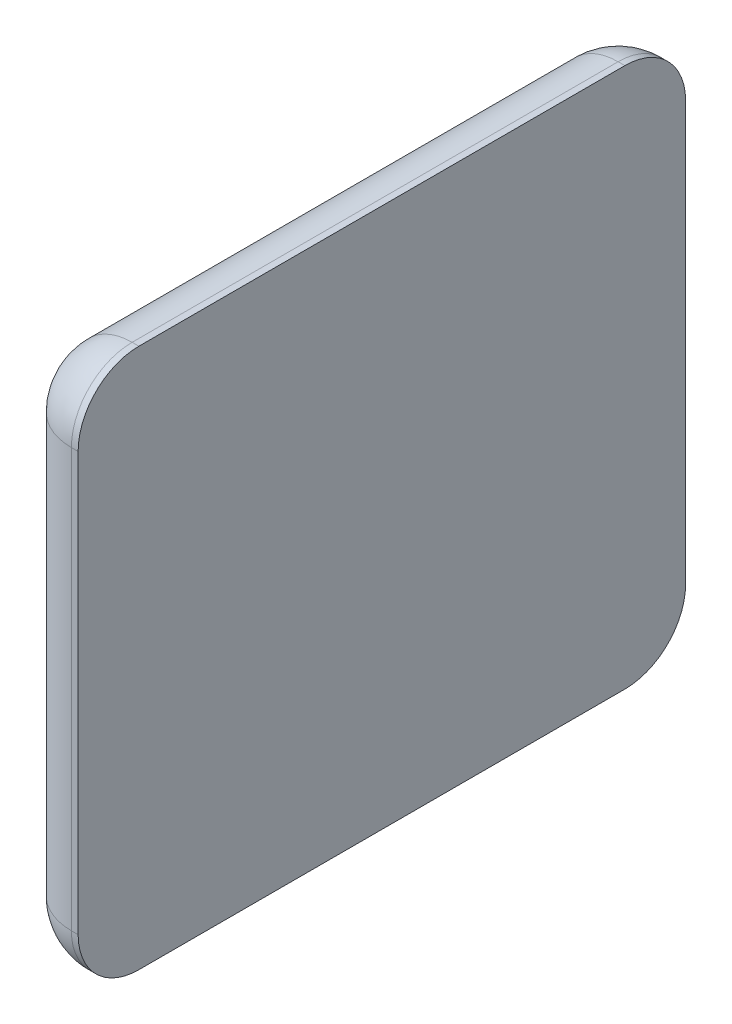
ISO-10303-21;
HEADER;
FILE_DESCRIPTION(('STEP AP214'),'2;1');
FILE_NAME('part.step','',(''),(''),'','','');
FILE_SCHEMA(('AUTOMOTIVE_DESIGN { 1 0 10303 214 1 1 1 1 }'));
ENDSEC;
DATA;
#1=APPLICATION_CONTEXT('core data for automotive mechanical design processes');
#2=APPLICATION_PROTOCOL_DEFINITION('international standard','automotive_design',2000,#1);
#3=PRODUCT_CONTEXT('',#1,'mechanical');
#4=PRODUCT('Part','Part','',(#3));
#5=PRODUCT_RELATED_PRODUCT_CATEGORY('part','',(#4));
#6=PRODUCT_DEFINITION_FORMATION('','',#4);
#7=PRODUCT_DEFINITION_CONTEXT('part definition',#1,'design');
#8=PRODUCT_DEFINITION('design','',#6,#7);
#9=PRODUCT_DEFINITION_SHAPE('','',#8);
#10=(LENGTH_UNIT() NAMED_UNIT(*) SI_UNIT(.MILLI.,.METRE.));
#11=(NAMED_UNIT(*) PLANE_ANGLE_UNIT() SI_UNIT($,.RADIAN.));
#12=(NAMED_UNIT(*) SI_UNIT($,.STERADIAN.) SOLID_ANGLE_UNIT());
#13=UNCERTAINTY_MEASURE_WITH_UNIT(LENGTH_MEASURE(1.E-05),#10,'distance_accuracy_value','');
#14=(GEOMETRIC_REPRESENTATION_CONTEXT(3) GLOBAL_UNCERTAINTY_ASSIGNED_CONTEXT((#13)) GLOBAL_UNIT_ASSIGNED_CONTEXT((#10,
#11,#12)) REPRESENTATION_CONTEXT('',''));
#15=CARTESIAN_POINT('',(0.,0.,0.));
#16=DIRECTION('',(0.,0.,1.));
#17=DIRECTION('',(1.,0.,0.));
#18=AXIS2_PLACEMENT_3D('',#15,#16,#17);
#19=CARTESIAN_POINT('',(-1.6,-0.8,0.));
#20=DIRECTION('',(1.,0.,0.));
#21=DIRECTION('',(0.,0.,1.));
#22=AXIS2_PLACEMENT_3D('',#19,#20,#21);
#23=PLANE('',#22);
#24=DIRECTION('',(0.,1.,0.));
#25=VECTOR('',#24,1.);
#26=CARTESIAN_POINT('',(-1.6,-0.62,1.62));
#27=LINE('',#26,#25);
#28=CARTESIAN_POINT('',(-1.6,-0.62,1.62));
#29=VERTEX_POINT('',#28);
#30=CARTESIAN_POINT('',(-1.6,0.62,1.62));
#31=VERTEX_POINT('',#30);
#32=EDGE_CURVE('E11',#29,#31,#27,.T.);
#33=ORIENTED_EDGE('',*,*,#32,.T.);
#34=DIRECTION('',(0.,0.,1.));
#35=VECTOR('',#34,1.);
#36=CARTESIAN_POINT('',(-1.6,0.62,0.18));
#37=LINE('',#36,#35);
#38=CARTESIAN_POINT('',(-1.6,0.62,0.18));
#39=VERTEX_POINT('',#38);
#40=EDGE_CURVE('E183',#39,#31,#37,.T.);
#41=ORIENTED_EDGE('',*,*,#40,.F.);
#42=DIRECTION('',(0.,1.,0.));
#43=VECTOR('',#42,1.);
#44=CARTESIAN_POINT('',(-1.6,-0.62,0.18));
#45=LINE('',#44,#43);
#46=CARTESIAN_POINT('',(-1.6,-0.62,0.18));
#47=VERTEX_POINT('',#46);
#48=EDGE_CURVE('E180',#47,#39,#45,.T.);
#49=ORIENTED_EDGE('',*,*,#48,.F.);
#50=DIRECTION('',(0.,0.,1.));
#51=VECTOR('',#50,1.);
#52=CARTESIAN_POINT('',(-1.6,-0.62,0.18));
#53=LINE('',#52,#51);
#54=EDGE_CURVE('E24',#47,#29,#53,.T.);
#55=ORIENTED_EDGE('',*,*,#54,.T.);
#56=EDGE_LOOP('',(#33,#41,#49,#55));
#57=FACE_BOUND('',#56,.T.);
#58=ADVANCED_FACE('F17',(#57),#23,.F.);
#59=CARTESIAN_POINT('',(-1.42,-0.62,0.));
#60=DIRECTION('',(0.,0.,1.));
#61=DIRECTION('',(-1.,0.,0.));
#62=AXIS2_PLACEMENT_3D('',#59,#60,#61);
#63=CYLINDRICAL_SURFACE('',#62,0.18);
#64=ORIENTED_EDGE('',*,*,#54,.F.);
#65=CARTESIAN_POINT('',(-1.42,-0.62,0.18));
#66=DIRECTION('',(0.,0.,1.));
#67=DIRECTION('',(-1.,0.,0.));
#68=AXIS2_PLACEMENT_3D('',#65,#66,#67);
#69=CIRCLE('',#68,0.18);
#70=CARTESIAN_POINT('',(-1.42,-0.8,0.18));
#71=VERTEX_POINT('',#70);
#72=EDGE_CURVE('E178',#47,#71,#69,.T.);
#73=ORIENTED_EDGE('',*,*,#72,.T.);
#74=DIRECTION('',(0.,0.,1.));
#75=VECTOR('',#74,1.);
#76=CARTESIAN_POINT('',(-1.42,-0.8,0.18));
#77=LINE('',#76,#75);
#78=CARTESIAN_POINT('',(-1.42,-0.8,1.62));
#79=VERTEX_POINT('',#78);
#80=EDGE_CURVE('E170',#71,#79,#77,.T.);
#81=ORIENTED_EDGE('',*,*,#80,.T.);
#82=CARTESIAN_POINT('',(-1.42,-0.62,1.62));
#83=DIRECTION('',(0.,0.,1.));
#84=DIRECTION('',(-1.,0.,0.));
#85=AXIS2_PLACEMENT_3D('',#82,#83,#84);
#86=CIRCLE('',#85,0.18);
#87=EDGE_CURVE('E159',#29,#79,#86,.T.);
#88=ORIENTED_EDGE('',*,*,#87,.F.);
#89=EDGE_LOOP('',(#64,#73,#81,#88));
#90=FACE_BOUND('',#89,.T.);
#91=ADVANCED_FACE('F185',(#90),#63,.T.);
#92=CARTESIAN_POINT('',(-1.42,-0.8,0.18));
#93=DIRECTION('',(0.,1.,0.));
#94=DIRECTION('',(-1.,0.,0.));
#95=AXIS2_PLACEMENT_3D('',#92,#93,#94);
#96=CYLINDRICAL_SURFACE('',#95,0.18);
#97=ORIENTED_EDGE('',*,*,#48,.T.);
#98=CARTESIAN_POINT('',(-1.42,0.62,0.18));
#99=DIRECTION('',(0.,1.,0.));
#100=DIRECTION('',(0.,0.,-1.));
#101=AXIS2_PLACEMENT_3D('',#98,#99,#100);
#102=CIRCLE('',#101,0.18);
#103=CARTESIAN_POINT('',(-1.42,0.62,0.));
#104=VERTEX_POINT('',#103);
#105=EDGE_CURVE('E172',#104,#39,#102,.T.);
#106=ORIENTED_EDGE('',*,*,#105,.F.);
#107=DIRECTION('',(0.,1.,0.));
#108=VECTOR('',#107,1.);
#109=CARTESIAN_POINT('',(-1.42,-0.62,0.));
#110=LINE('',#109,#108);
#111=CARTESIAN_POINT('',(-1.42,-0.62,0.));
#112=VERTEX_POINT('',#111);
#113=EDGE_CURVE('E162',#112,#104,#110,.T.);
#114=ORIENTED_EDGE('',*,*,#113,.F.);
#115=CARTESIAN_POINT('',(-1.42,-0.62,0.18));
#116=DIRECTION('',(0.,1.,0.));
#117=DIRECTION('',(0.,0.,-1.));
#118=AXIS2_PLACEMENT_3D('',#115,#116,#117);
#119=CIRCLE('',#118,0.18);
#120=EDGE_CURVE('E149',#112,#47,#119,.T.);
#121=ORIENTED_EDGE('',*,*,#120,.T.);
#122=EDGE_LOOP('',(#97,#106,#114,#121));
#123=FACE_BOUND('',#122,.T.);
#124=ADVANCED_FACE('F247',(#123),#96,.T.);
#125=CARTESIAN_POINT('',(-1.42,-0.8,1.62));
#126=DIRECTION('',(0.,1.,0.));
#127=DIRECTION('',(-1.,0.,0.));
#128=AXIS2_PLACEMENT_3D('',#125,#126,#127);
#129=CYLINDRICAL_SURFACE('',#128,0.18);
#130=CARTESIAN_POINT('',(-1.42,-0.62,1.62));
#131=DIRECTION('',(0.,-1.,0.));
#132=DIRECTION('',(0.,0.,1.));
#133=AXIS2_PLACEMENT_3D('',#130,#131,#132);
#134=CIRCLE('',#133,0.18);
#135=CARTESIAN_POINT('',(-1.42,-0.62,1.8));
#136=VERTEX_POINT('',#135);
#137=EDGE_CURVE('E175',#136,#29,#134,.T.);
#138=ORIENTED_EDGE('',*,*,#137,.F.);
#139=DIRECTION('',(0.,1.,0.));
#140=VECTOR('',#139,1.);
#141=CARTESIAN_POINT('',(-1.42,-0.62,1.8));
#142=LINE('',#141,#140);
#143=CARTESIAN_POINT('',(-1.42,0.62,1.8));
#144=VERTEX_POINT('',#143);
#145=EDGE_CURVE('E165',#136,#144,#142,.T.);
#146=ORIENTED_EDGE('',*,*,#145,.T.);
#147=CARTESIAN_POINT('',(-1.42,0.62,1.62));
#148=DIRECTION('',(0.,1.,0.));
#149=DIRECTION('',(-1.,0.,0.));
#150=AXIS2_PLACEMENT_3D('',#147,#148,#149);
#151=CIRCLE('',#150,0.18);
#152=EDGE_CURVE('E152',#31,#144,#151,.T.);
#153=ORIENTED_EDGE('',*,*,#152,.F.);
#154=ORIENTED_EDGE('',*,*,#32,.F.);
#155=EDGE_LOOP('',(#138,#146,#153,#154));
#156=FACE_BOUND('',#155,.T.);
#157=ADVANCED_FACE('F193',(#156),#129,.T.);
#158=CARTESIAN_POINT('',(-1.42,0.62,0.));
#159=DIRECTION('',(0.,0.,1.));
#160=DIRECTION('',(-1.,0.,0.));
#161=AXIS2_PLACEMENT_3D('',#158,#159,#160);
#162=CYLINDRICAL_SURFACE('',#161,0.18);
#163=CARTESIAN_POINT('',(-1.42,0.62,1.62));
#164=DIRECTION('',(0.,0.,1.));
#165=DIRECTION('',(0.,1.,0.));
#166=AXIS2_PLACEMENT_3D('',#163,#164,#165);
#167=CIRCLE('',#166,0.18);
#168=CARTESIAN_POINT('',(-1.42,0.8,1.62));
#169=VERTEX_POINT('',#168);
#170=EDGE_CURVE('E167',#169,#31,#167,.T.);
#171=ORIENTED_EDGE('',*,*,#170,.F.);
#172=DIRECTION('',(0.,0.,1.));
#173=VECTOR('',#172,1.);
#174=CARTESIAN_POINT('',(-1.42,0.8,0.18));
#175=LINE('',#174,#173);
#176=CARTESIAN_POINT('',(-1.42,0.8,0.18));
#177=VERTEX_POINT('',#176);
#178=EDGE_CURVE('E97',#177,#169,#175,.T.);
#179=ORIENTED_EDGE('',*,*,#178,.F.);
#180=CARTESIAN_POINT('',(-1.42,0.62,0.18));
#181=DIRECTION('',(0.,0.,-1.));
#182=DIRECTION('',(-1.,0.,0.));
#183=AXIS2_PLACEMENT_3D('',#180,#181,#182);
#184=CIRCLE('',#183,0.18);
#185=EDGE_CURVE('E146',#39,#177,#184,.T.);
#186=ORIENTED_EDGE('',*,*,#185,.F.);
#187=ORIENTED_EDGE('',*,*,#40,.T.);
#188=EDGE_LOOP('',(#171,#179,#186,#187));
#189=FACE_BOUND('',#188,.T.);
#190=ADVANCED_FACE('F198',(#189),#162,.T.);
#191=CARTESIAN_POINT('',(-1.42,-0.62,0.18));
#192=DIRECTION('',(0.,0.,1.));
#193=DIRECTION('',(-1.,0.,0.));
#194=AXIS2_PLACEMENT_3D('',#191,#192,#193);
#195=SPHERICAL_SURFACE('',#194,0.18);
#196=CARTESIAN_POINT('',(-1.42,-0.62,0.18));
#197=DIRECTION('',(-1.,0.,0.));
#198=DIRECTION('',(0.,0.,-1.));
#199=AXIS2_PLACEMENT_3D('',#196,#197,#198);
#200=CIRCLE('',#199,0.18);
#201=EDGE_CURVE('E156',#112,#71,#200,.T.);
#202=ORIENTED_EDGE('',*,*,#201,.T.);
#203=ORIENTED_EDGE('',*,*,#72,.F.);
#204=ORIENTED_EDGE('',*,*,#120,.F.);
#205=EDGE_LOOP('',(#202,#203,#204));
#206=FACE_BOUND('',#205,.T.);
#207=ADVANCED_FACE('F222',(#206),#195,.T.);
#208=CARTESIAN_POINT('',(-1.42,-0.62,1.62));
#209=DIRECTION('',(0.,0.,-1.));
#210=DIRECTION('',(-1.,0.,0.));
#211=AXIS2_PLACEMENT_3D('',#208,#209,#210);
#212=SPHERICAL_SURFACE('',#211,0.18);
#213=ORIENTED_EDGE('',*,*,#137,.T.);
#214=ORIENTED_EDGE('',*,*,#87,.T.);
#215=CARTESIAN_POINT('',(-1.42,-0.62,1.62));
#216=DIRECTION('',(1.,0.,0.));
#217=DIRECTION('',(0.,0.,1.));
#218=AXIS2_PLACEMENT_3D('',#215,#216,#217);
#219=CIRCLE('',#218,0.18);
#220=EDGE_CURVE('E137',#136,#79,#219,.T.);
#221=ORIENTED_EDGE('',*,*,#220,.F.);
#222=EDGE_LOOP('',(#213,#214,#221));
#223=FACE_BOUND('',#222,.T.);
#224=ADVANCED_FACE('F190',(#223),#212,.T.);
#225=CARTESIAN_POINT('',(-1.6,-0.8,0.));
#226=DIRECTION('',(0.,1.,0.));
#227=DIRECTION('',(0.,0.,1.));
#228=AXIS2_PLACEMENT_3D('',#225,#226,#227);
#229=PLANE('',#228);
#230=DIRECTION('',(1.,0.,0.));
#231=VECTOR('',#230,1.);
#232=CARTESIAN_POINT('',(-1.42,-0.8,1.62));
#233=LINE('',#232,#231);
#234=CARTESIAN_POINT('',(-1.4,-0.8,1.62));
#235=VERTEX_POINT('',#234);
#236=EDGE_CURVE('E143',#79,#235,#233,.T.);
#237=ORIENTED_EDGE('',*,*,#236,.F.);
#238=ORIENTED_EDGE('',*,*,#80,.F.);
#239=DIRECTION('',(1.,0.,0.));
#240=VECTOR('',#239,1.);
#241=CARTESIAN_POINT('',(-1.42,-0.8,0.18));
#242=LINE('',#241,#240);
#243=CARTESIAN_POINT('',(-1.4,-0.8,0.18));
#244=VERTEX_POINT('',#243);
#245=EDGE_CURVE('E132',#71,#244,#242,.T.);
#246=ORIENTED_EDGE('',*,*,#245,.T.);
#247=DIRECTION('',(0.,0.,1.));
#248=VECTOR('',#247,1.);
#249=CARTESIAN_POINT('',(-1.4,-0.8,0.18));
#250=LINE('',#249,#248);
#251=EDGE_CURVE('E126',#244,#235,#250,.T.);
#252=ORIENTED_EDGE('',*,*,#251,.T.);
#253=EDGE_LOOP('',(#237,#238,#246,#252));
#254=FACE_BOUND('',#253,.T.);
#255=ADVANCED_FACE('F224',(#254),#229,.F.);
#256=CARTESIAN_POINT('',(-1.6,-0.8,0.));
#257=DIRECTION('',(0.,0.,1.));
#258=DIRECTION('',(1.,0.,0.));
#259=AXIS2_PLACEMENT_3D('',#256,#257,#258);
#260=PLANE('',#259);
#261=DIRECTION('',(1.,0.,0.));
#262=VECTOR('',#261,1.);
#263=CARTESIAN_POINT('',(-1.42,-0.62,0.));
#264=LINE('',#263,#262);
#265=CARTESIAN_POINT('',(-1.4,-0.62,0.));
#266=VERTEX_POINT('',#265);
#267=EDGE_CURVE('E140',#112,#266,#264,.T.);
#268=ORIENTED_EDGE('',*,*,#267,.F.);
#269=ORIENTED_EDGE('',*,*,#113,.T.);
#270=DIRECTION('',(1.,0.,0.));
#271=VECTOR('',#270,1.);
#272=CARTESIAN_POINT('',(-1.42,0.62,0.));
#273=LINE('',#272,#271);
#274=CARTESIAN_POINT('',(-1.4,0.62,0.));
#275=VERTEX_POINT('',#274);
#276=EDGE_CURVE('E128',#104,#275,#273,.T.);
#277=ORIENTED_EDGE('',*,*,#276,.T.);
#278=DIRECTION('',(0.,1.,0.));
#279=VECTOR('',#278,1.);
#280=CARTESIAN_POINT('',(-1.4,-0.62,0.));
#281=LINE('',#280,#279);
#282=EDGE_CURVE('E117',#266,#275,#281,.T.);
#283=ORIENTED_EDGE('',*,*,#282,.F.);
#284=EDGE_LOOP('',(#268,#269,#277,#283));
#285=FACE_BOUND('',#284,.T.);
#286=ADVANCED_FACE('F214',(#285),#260,.F.);
#287=CARTESIAN_POINT('',(-1.42,0.62,0.18));
#288=DIRECTION('',(0.,0.,1.));
#289=DIRECTION('',(-1.,0.,0.));
#290=AXIS2_PLACEMENT_3D('',#287,#288,#289);
#291=SPHERICAL_SURFACE('',#290,0.18);
#292=CARTESIAN_POINT('',(-1.42,0.62,0.18));
#293=DIRECTION('',(1.,0.,0.));
#294=DIRECTION('',(0.,0.,-1.));
#295=AXIS2_PLACEMENT_3D('',#292,#293,#294);
#296=CIRCLE('',#295,0.18);
#297=EDGE_CURVE('E134',#104,#177,#296,.T.);
#298=ORIENTED_EDGE('',*,*,#297,.F.);
#299=ORIENTED_EDGE('',*,*,#105,.T.);
#300=ORIENTED_EDGE('',*,*,#185,.T.);
#301=EDGE_LOOP('',(#298,#299,#300));
#302=FACE_BOUND('',#301,.T.);
#303=ADVANCED_FACE('F232',(#302),#291,.T.);
#304=CARTESIAN_POINT('',(-1.6,-0.8,1.8));
#305=DIRECTION('',(0.,0.,1.));
#306=DIRECTION('',(1.,0.,0.));
#307=AXIS2_PLACEMENT_3D('',#304,#305,#306);
#308=PLANE('',#307);
#309=DIRECTION('',(0.,1.,0.));
#310=VECTOR('',#309,1.);
#311=CARTESIAN_POINT('',(-1.4,-0.62,1.8));
#312=LINE('',#311,#310);
#313=CARTESIAN_POINT('',(-1.4,-0.62,1.8));
#314=VERTEX_POINT('',#313);
#315=CARTESIAN_POINT('',(-1.4,0.62,1.8));
#316=VERTEX_POINT('',#315);
#317=EDGE_CURVE('E130',#314,#316,#312,.T.);
#318=ORIENTED_EDGE('',*,*,#317,.T.);
#319=DIRECTION('',(1.,0.,0.));
#320=VECTOR('',#319,1.);
#321=CARTESIAN_POINT('',(-1.42,0.62,1.8));
#322=LINE('',#321,#320);
#323=EDGE_CURVE('E108',#144,#316,#322,.T.);
#324=ORIENTED_EDGE('',*,*,#323,.F.);
#325=ORIENTED_EDGE('',*,*,#145,.F.);
#326=DIRECTION('',(1.,0.,0.));
#327=VECTOR('',#326,1.);
#328=CARTESIAN_POINT('',(-1.42,-0.62,1.8));
#329=LINE('',#328,#327);
#330=EDGE_CURVE('E200',#136,#314,#329,.T.);
#331=ORIENTED_EDGE('',*,*,#330,.T.);
#332=EDGE_LOOP('',(#318,#324,#325,#331));
#333=FACE_BOUND('',#332,.T.);
#334=ADVANCED_FACE('F230',(#333),#308,.T.);
#335=CARTESIAN_POINT('',(-1.42,0.62,1.62));
#336=DIRECTION('',(0.,-1.,0.));
#337=DIRECTION('',(-1.,0.,0.));
#338=AXIS2_PLACEMENT_3D('',#335,#336,#337);
#339=SPHERICAL_SURFACE('',#338,0.18);
#340=ORIENTED_EDGE('',*,*,#170,.T.);
#341=ORIENTED_EDGE('',*,*,#152,.T.);
#342=CARTESIAN_POINT('',(-1.42,0.62,1.62));
#343=DIRECTION('',(1.,0.,0.));
#344=DIRECTION('',(0.,1.,0.));
#345=AXIS2_PLACEMENT_3D('',#342,#343,#344);
#346=CIRCLE('',#345,0.18);
#347=EDGE_CURVE('E121',#169,#144,#346,.T.);
#348=ORIENTED_EDGE('',*,*,#347,.F.);
#349=EDGE_LOOP('',(#340,#341,#348));
#350=FACE_BOUND('',#349,.T.);
#351=ADVANCED_FACE('F199',(#350),#339,.T.);
#352=CARTESIAN_POINT('',(-1.6,0.8,0.));
#353=DIRECTION('',(0.,1.,0.));
#354=DIRECTION('',(0.,0.,1.));
#355=AXIS2_PLACEMENT_3D('',#352,#353,#354);
#356=PLANE('',#355);
#357=DIRECTION('',(0.,0.,1.));
#358=VECTOR('',#357,1.);
#359=CARTESIAN_POINT('',(-1.4,0.8,0.18));
#360=LINE('',#359,#358);
#361=CARTESIAN_POINT('',(-1.4,0.8,0.18));
#362=VERTEX_POINT('',#361);
#363=CARTESIAN_POINT('',(-1.4,0.8,1.62));
#364=VERTEX_POINT('',#363);
#365=EDGE_CURVE('E95',#362,#364,#360,.T.);
#366=ORIENTED_EDGE('',*,*,#365,.F.);
#367=DIRECTION('',(1.,0.,0.));
#368=VECTOR('',#367,1.);
#369=CARTESIAN_POINT('',(-1.42,0.8,0.18));
#370=LINE('',#369,#368);
#371=EDGE_CURVE('E118',#177,#362,#370,.T.);
#372=ORIENTED_EDGE('',*,*,#371,.F.);
#373=ORIENTED_EDGE('',*,*,#178,.T.);
#374=DIRECTION('',(1.,0.,0.));
#375=VECTOR('',#374,1.);
#376=CARTESIAN_POINT('',(-1.42,0.8,1.62));
#377=LINE('',#376,#375);
#378=EDGE_CURVE('E90',#169,#364,#377,.T.);
#379=ORIENTED_EDGE('',*,*,#378,.T.);
#380=EDGE_LOOP('',(#366,#372,#373,#379));
#381=FACE_BOUND('',#380,.T.);
#382=ADVANCED_FACE('F92',(#381),#356,.T.);
#383=CARTESIAN_POINT('',(-1.6,-0.62,0.18));
#384=DIRECTION('',(1.,0.,0.));
#385=DIRECTION('',(0.,-1.,0.));
#386=AXIS2_PLACEMENT_3D('',#383,#384,#385);
#387=CYLINDRICAL_SURFACE('',#386,0.18);
#388=ORIENTED_EDGE('',*,*,#201,.F.);
#389=ORIENTED_EDGE('',*,*,#267,.T.);
#390=CARTESIAN_POINT('',(-1.4,-0.62,0.18));
#391=DIRECTION('',(1.,0.,0.));
#392=DIRECTION('',(0.,-1.,0.));
#393=AXIS2_PLACEMENT_3D('',#390,#391,#392);
#394=CIRCLE('',#393,0.18);
#395=EDGE_CURVE('E100',#244,#266,#394,.T.);
#396=ORIENTED_EDGE('',*,*,#395,.F.);
#397=ORIENTED_EDGE('',*,*,#245,.F.);
#398=EDGE_LOOP('',(#388,#389,#396,#397));
#399=FACE_BOUND('',#398,.T.);
#400=ADVANCED_FACE('F217',(#399),#387,.T.);
#401=CARTESIAN_POINT('',(-1.6,-0.62,1.62));
#402=DIRECTION('',(1.,0.,0.));
#403=DIRECTION('',(0.,-1.,0.));
#404=AXIS2_PLACEMENT_3D('',#401,#402,#403);
#405=CYLINDRICAL_SURFACE('',#404,0.18);
#406=ORIENTED_EDGE('',*,*,#236,.T.);
#407=CARTESIAN_POINT('',(-1.4,-0.62,1.62));
#408=DIRECTION('',(-1.,0.,0.));
#409=DIRECTION('',(0.,-1.,0.));
#410=AXIS2_PLACEMENT_3D('',#407,#408,#409);
#411=CIRCLE('',#410,0.18);
#412=EDGE_CURVE('E201',#235,#314,#411,.T.);
#413=ORIENTED_EDGE('',*,*,#412,.T.);
#414=ORIENTED_EDGE('',*,*,#330,.F.);
#415=ORIENTED_EDGE('',*,*,#220,.T.);
#416=EDGE_LOOP('',(#406,#413,#414,#415));
#417=FACE_BOUND('',#416,.T.);
#418=ADVANCED_FACE('F227',(#417),#405,.T.);
#419=CARTESIAN_POINT('',(-1.4,-0.8,0.));
#420=DIRECTION('',(1.,0.,0.));
#421=DIRECTION('',(0.,0.,1.));
#422=AXIS2_PLACEMENT_3D('',#419,#420,#421);
#423=PLANE('',#422);
#424=ORIENTED_EDGE('',*,*,#251,.F.);
#425=ORIENTED_EDGE('',*,*,#395,.T.);
#426=ORIENTED_EDGE('',*,*,#282,.T.);
#427=CARTESIAN_POINT('',(-1.4,0.62,0.18));
#428=DIRECTION('',(-1.,0.,0.));
#429=DIRECTION('',(0.,1.,0.));
#430=AXIS2_PLACEMENT_3D('',#427,#428,#429);
#431=CIRCLE('',#430,0.18);
#432=EDGE_CURVE('E101',#362,#275,#431,.T.);
#433=ORIENTED_EDGE('',*,*,#432,.F.);
#434=ORIENTED_EDGE('',*,*,#365,.T.);
#435=CARTESIAN_POINT('',(-1.4,0.62,1.62));
#436=DIRECTION('',(1.,0.,0.));
#437=DIRECTION('',(0.,1.,0.));
#438=AXIS2_PLACEMENT_3D('',#435,#436,#437);
#439=CIRCLE('',#438,0.18);
#440=EDGE_CURVE('E105',#364,#316,#439,.T.);
#441=ORIENTED_EDGE('',*,*,#440,.T.);
#442=ORIENTED_EDGE('',*,*,#317,.F.);
#443=ORIENTED_EDGE('',*,*,#412,.F.);
#444=EDGE_LOOP('',(#424,#425,#426,#433,#434,#441,#442,#443));
#445=FACE_BOUND('',#444,.T.);
#446=ADVANCED_FACE('F114',(#445),#423,.T.);
#447=CARTESIAN_POINT('',(-1.6,0.62,0.18));
#448=DIRECTION('',(1.,0.,0.));
#449=DIRECTION('',(0.,1.,0.));
#450=AXIS2_PLACEMENT_3D('',#447,#448,#449);
#451=CYLINDRICAL_SURFACE('',#450,0.18);
#452=ORIENTED_EDGE('',*,*,#371,.T.);
#453=ORIENTED_EDGE('',*,*,#432,.T.);
#454=ORIENTED_EDGE('',*,*,#276,.F.);
#455=ORIENTED_EDGE('',*,*,#297,.T.);
#456=EDGE_LOOP('',(#452,#453,#454,#455));
#457=FACE_BOUND('',#456,.T.);
#458=ADVANCED_FACE('F210',(#457),#451,.T.);
#459=CARTESIAN_POINT('',(-1.6,0.62,1.62));
#460=DIRECTION('',(1.,0.,0.));
#461=DIRECTION('',(0.,1.,0.));
#462=AXIS2_PLACEMENT_3D('',#459,#460,#461);
#463=CYLINDRICAL_SURFACE('',#462,0.18);
#464=ORIENTED_EDGE('',*,*,#347,.T.);
#465=ORIENTED_EDGE('',*,*,#323,.T.);
#466=ORIENTED_EDGE('',*,*,#440,.F.);
#467=ORIENTED_EDGE('',*,*,#378,.F.);
#468=EDGE_LOOP('',(#464,#465,#466,#467));
#469=FACE_BOUND('',#468,.T.);
#470=ADVANCED_FACE('F106',(#469),#463,.T.);
#471=CLOSED_SHELL('',(#58,#91,#124,#157,#190,#207,#224,#255,#286,#303,#334,#351,#382,#400,#418,
#446,#458,#470));
#472=MANIFOLD_SOLID_BREP('B1',#471);
#473=ADVANCED_BREP_SHAPE_REPRESENTATION('',(#18,#472),#14);
#474=SHAPE_DEFINITION_REPRESENTATION(#9,#473);
ENDSEC;
END-ISO-10303-21;
